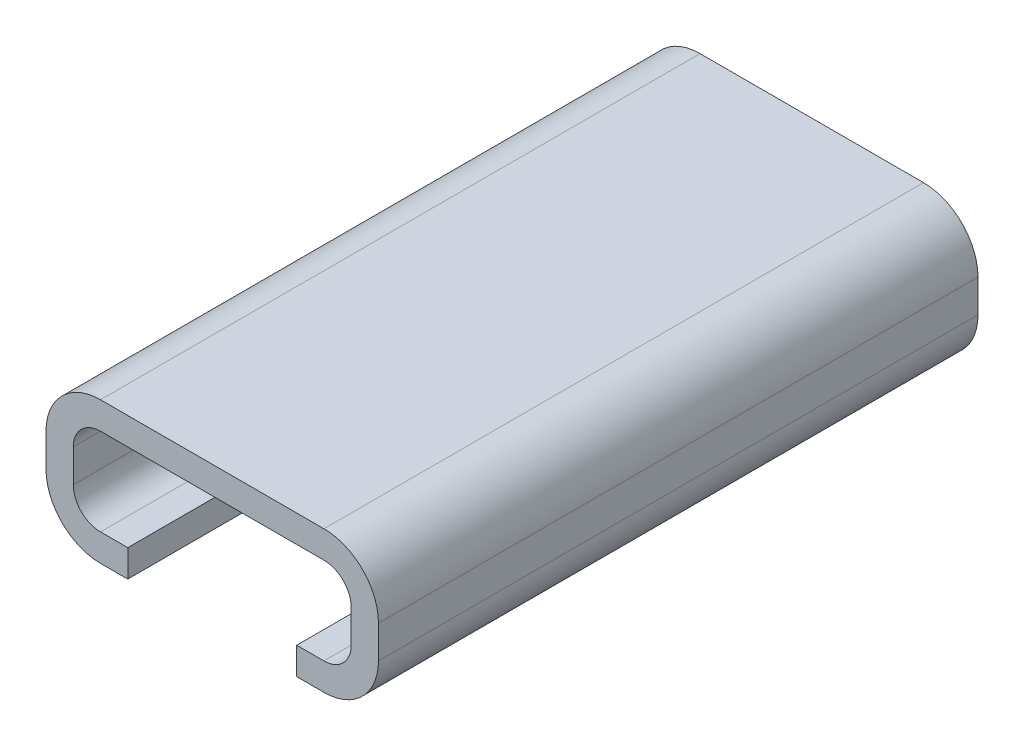
ISO-10303-21;
HEADER;
FILE_DESCRIPTION(('STEP AP214'),'2;1');
FILE_NAME('part.step','',(''),(''),'','','');
FILE_SCHEMA(('AUTOMOTIVE_DESIGN { 1 0 10303 214 1 1 1 1 }'));
ENDSEC;
DATA;
#1=APPLICATION_CONTEXT('core data for automotive mechanical design processes');
#2=APPLICATION_PROTOCOL_DEFINITION('international standard','automotive_design',2000,#1);
#3=PRODUCT_CONTEXT('',#1,'mechanical');
#4=PRODUCT('Part','Part','',(#3));
#5=PRODUCT_RELATED_PRODUCT_CATEGORY('part','',(#4));
#6=PRODUCT_DEFINITION_FORMATION('','',#4);
#7=PRODUCT_DEFINITION_CONTEXT('part definition',#1,'design');
#8=PRODUCT_DEFINITION('design','',#6,#7);
#9=PRODUCT_DEFINITION_SHAPE('','',#8);
#10=(LENGTH_UNIT() NAMED_UNIT(*) SI_UNIT(.MILLI.,.METRE.));
#11=(NAMED_UNIT(*) PLANE_ANGLE_UNIT() SI_UNIT($,.RADIAN.));
#12=(NAMED_UNIT(*) SI_UNIT($,.STERADIAN.) SOLID_ANGLE_UNIT());
#13=UNCERTAINTY_MEASURE_WITH_UNIT(LENGTH_MEASURE(1.E-05),#10,'distance_accuracy_value','');
#14=(GEOMETRIC_REPRESENTATION_CONTEXT(3) GLOBAL_UNCERTAINTY_ASSIGNED_CONTEXT((#13)) GLOBAL_UNIT_ASSIGNED_CONTEXT((#10,
#11,#12)) REPRESENTATION_CONTEXT('',''));
#15=CARTESIAN_POINT('',(0.,0.,0.));
#16=DIRECTION('',(0.,0.,1.));
#17=DIRECTION('',(1.,0.,0.));
#18=AXIS2_PLACEMENT_3D('',#15,#16,#17);
#19=CARTESIAN_POINT('',(4.1,-1.6,10.));
#20=DIRECTION('',(0.,-1.,0.));
#21=DIRECTION('',(0.,0.,-1.));
#22=AXIS2_PLACEMENT_3D('',#19,#20,#21);
#23=PLANE('',#22);
#24=DIRECTION('',(-1.,0.,0.));
#25=VECTOR('',#24,1.);
#26=CARTESIAN_POINT('',(4.1,-1.6,10.));
#27=LINE('',#26,#25);
#28=CARTESIAN_POINT('',(-3.1,-1.6,10.));
#29=VERTEX_POINT('',#28);
#30=CARTESIAN_POINT('',(-4.1,-1.6,10.));
#31=VERTEX_POINT('',#30);
#32=EDGE_CURVE('E444',#29,#31,#27,.T.);
#33=ORIENTED_EDGE('',*,*,#32,.F.);
#34=DIRECTION('',(0.,0.,1.));
#35=VECTOR('',#34,1.);
#36=CARTESIAN_POINT('',(-3.1,-1.6,10.));
#37=LINE('',#36,#35);
#38=CARTESIAN_POINT('',(-3.1,-1.6,0.));
#39=VERTEX_POINT('',#38);
#40=EDGE_CURVE('E311',#39,#29,#37,.T.);
#41=ORIENTED_EDGE('',*,*,#40,.F.);
#42=DIRECTION('',(-1.,0.,0.));
#43=VECTOR('',#42,1.);
#44=CARTESIAN_POINT('',(4.1,-1.6,0.));
#45=LINE('',#44,#43);
#46=CARTESIAN_POINT('',(-4.1,-1.6,0.));
#47=VERTEX_POINT('',#46);
#48=EDGE_CURVE('E468',#39,#47,#45,.T.);
#49=ORIENTED_EDGE('',*,*,#48,.T.);
#50=DIRECTION('',(0.,0.,-1.));
#51=VECTOR('',#50,1.);
#52=CARTESIAN_POINT('',(-4.1,-1.6,10.));
#53=LINE('',#52,#51);
#54=EDGE_CURVE('E497',#31,#47,#53,.T.);
#55=ORIENTED_EDGE('',*,*,#54,.F.);
#56=EDGE_LOOP('',(#33,#41,#49,#55));
#57=FACE_BOUND('',#56,.T.);
#58=ADVANCED_FACE('F83',(#57),#23,.F.);
#59=CARTESIAN_POINT('',(4.1,-1.6,-12.));
#60=DIRECTION('',(0.,-1.,0.));
#61=DIRECTION('',(0.,0.,1.));
#62=AXIS2_PLACEMENT_3D('',#59,#60,#61);
#63=PLANE('',#62);
#64=DIRECTION('',(-1.,0.,0.));
#65=VECTOR('',#64,1.);
#66=CARTESIAN_POINT('',(4.1,-1.6,-12.));
#67=LINE('',#66,#65);
#68=CARTESIAN_POINT('',(4.1,-1.6,-12.));
#69=VERTEX_POINT('',#68);
#70=CARTESIAN_POINT('',(3.1,-1.6,-12.));
#71=VERTEX_POINT('',#70);
#72=EDGE_CURVE('E354',#69,#71,#67,.T.);
#73=ORIENTED_EDGE('',*,*,#72,.T.);
#74=DIRECTION('',(0.,0.,-1.));
#75=VECTOR('',#74,1.);
#76=CARTESIAN_POINT('',(3.1,-1.6,-12.));
#77=LINE('',#76,#75);
#78=CARTESIAN_POINT('',(3.1,-1.6,-1.99999999999999));
#79=VERTEX_POINT('',#78);
#80=EDGE_CURVE('E374',#79,#71,#77,.T.);
#81=ORIENTED_EDGE('',*,*,#80,.F.);
#82=DIRECTION('',(-1.,0.,0.));
#83=VECTOR('',#82,1.);
#84=CARTESIAN_POINT('',(4.1,-1.6,-2.));
#85=LINE('',#84,#83);
#86=CARTESIAN_POINT('',(4.1,-1.6,-2.));
#87=VERTEX_POINT('',#86);
#88=EDGE_CURVE('E298',#87,#79,#85,.T.);
#89=ORIENTED_EDGE('',*,*,#88,.F.);
#90=DIRECTION('',(0.,0.,1.));
#91=VECTOR('',#90,1.);
#92=CARTESIAN_POINT('',(4.1,-1.6,-12.));
#93=LINE('',#92,#91);
#94=EDGE_CURVE('E398',#69,#87,#93,.T.);
#95=ORIENTED_EDGE('',*,*,#94,.F.);
#96=EDGE_LOOP('',(#73,#81,#89,#95));
#97=FACE_BOUND('',#96,.T.);
#98=ADVANCED_FACE('F624',(#97),#63,.F.);
#99=CARTESIAN_POINT('',(4.1,0.600000000000001,10.));
#100=DIRECTION('',(0.,0.,-1.));
#101=DIRECTION('',(-1.,0.,0.));
#102=AXIS2_PLACEMENT_3D('',#99,#100,#101);
#103=PLANE('',#102);
#104=DIRECTION('',(-1.,0.,0.));
#105=VECTOR('',#104,1.);
#106=CARTESIAN_POINT('',(4.1,-2.6,10.));
#107=LINE('',#106,#105);
#108=CARTESIAN_POINT('',(-3.1,-2.6,10.));
#109=VERTEX_POINT('',#108);
#110=CARTESIAN_POINT('',(-4.1,-2.6,10.));
#111=VERTEX_POINT('',#110);
#112=EDGE_CURVE('E515',#109,#111,#107,.T.);
#113=ORIENTED_EDGE('',*,*,#112,.F.);
#114=DIRECTION('',(0.,-1.,0.));
#115=VECTOR('',#114,1.);
#116=CARTESIAN_POINT('',(-3.1,10.1660528640662,10.));
#117=LINE('',#116,#115);
#118=EDGE_CURVE('E327',#29,#109,#117,.T.);
#119=ORIENTED_EDGE('',*,*,#118,.F.);
#120=ORIENTED_EDGE('',*,*,#32,.T.);
#121=CARTESIAN_POINT('',(-4.1,-0.600000000000001,10.));
#122=DIRECTION('',(0.,0.,-1.));
#123=DIRECTION('',(-1.,0.,0.));
#124=AXIS2_PLACEMENT_3D('',#121,#122,#123);
#125=CIRCLE('',#124,0.999999999999999);
#126=CARTESIAN_POINT('',(-5.1,-0.600000000000001,10.));
#127=VERTEX_POINT('',#126);
#128=EDGE_CURVE('E441',#31,#127,#125,.T.);
#129=ORIENTED_EDGE('',*,*,#128,.T.);
#130=DIRECTION('',(0.,1.,0.));
#131=VECTOR('',#130,1.);
#132=CARTESIAN_POINT('',(-5.1,-0.600000000000001,10.));
#133=LINE('',#132,#131);
#134=CARTESIAN_POINT('',(-5.1,0.600000000000001,10.));
#135=VERTEX_POINT('',#134);
#136=EDGE_CURVE('E437',#127,#135,#133,.T.);
#137=ORIENTED_EDGE('',*,*,#136,.T.);
#138=CARTESIAN_POINT('',(-4.1,0.600000000000001,10.));
#139=DIRECTION('',(0.,0.,1.));
#140=DIRECTION('',(1.,0.,0.));
#141=AXIS2_PLACEMENT_3D('',#138,#139,#140);
#142=CIRCLE('',#141,0.999999999999999);
#143=CARTESIAN_POINT('',(-4.1,1.6,10.));
#144=VERTEX_POINT('',#143);
#145=EDGE_CURVE('E435',#144,#135,#142,.T.);
#146=ORIENTED_EDGE('',*,*,#145,.F.);
#147=DIRECTION('',(1.,0.,0.));
#148=VECTOR('',#147,1.);
#149=CARTESIAN_POINT('',(-4.1,1.6,10.));
#150=LINE('',#149,#148);
#151=CARTESIAN_POINT('',(4.1,1.6,10.));
#152=VERTEX_POINT('',#151);
#153=EDGE_CURVE('E457',#144,#152,#150,.T.);
#154=ORIENTED_EDGE('',*,*,#153,.T.);
#155=CARTESIAN_POINT('',(4.1,0.600000000000001,10.));
#156=DIRECTION('',(0.,0.,-1.));
#157=DIRECTION('',(-1.,0.,0.));
#158=AXIS2_PLACEMENT_3D('',#155,#156,#157);
#159=CIRCLE('',#158,0.999999999999999);
#160=CARTESIAN_POINT('',(5.1,0.600000000000001,10.));
#161=VERTEX_POINT('',#160);
#162=EDGE_CURVE('E454',#152,#161,#159,.T.);
#163=ORIENTED_EDGE('',*,*,#162,.T.);
#164=DIRECTION('',(0.,-1.,0.));
#165=VECTOR('',#164,1.);
#166=CARTESIAN_POINT('',(5.1,0.600000000000001,10.));
#167=LINE('',#166,#165);
#168=CARTESIAN_POINT('',(5.1,-0.600000000000001,10.));
#169=VERTEX_POINT('',#168);
#170=EDGE_CURVE('E451',#161,#169,#167,.T.);
#171=ORIENTED_EDGE('',*,*,#170,.T.);
#172=CARTESIAN_POINT('',(4.1,-0.600000000000001,10.));
#173=DIRECTION('',(0.,0.,-1.));
#174=DIRECTION('',(-1.,0.,0.));
#175=AXIS2_PLACEMENT_3D('',#172,#173,#174);
#176=CIRCLE('',#175,0.999999999999999);
#177=CARTESIAN_POINT('',(4.1,-1.6,10.));
#178=VERTEX_POINT('',#177);
#179=EDGE_CURVE('E448',#169,#178,#176,.T.);
#180=ORIENTED_EDGE('',*,*,#179,.T.);
#181=CARTESIAN_POINT('',(3.1,-1.6,10.));
#182=VERTEX_POINT('',#181);
#183=EDGE_CURVE('E445',#178,#182,#27,.T.);
#184=ORIENTED_EDGE('',*,*,#183,.T.);
#185=DIRECTION('',(0.,-1.,0.));
#186=VECTOR('',#185,1.);
#187=CARTESIAN_POINT('',(3.1,10.1660528640662,10.));
#188=LINE('',#187,#186);
#189=CARTESIAN_POINT('',(3.1,-2.6,10.));
#190=VERTEX_POINT('',#189);
#191=EDGE_CURVE('E338',#182,#190,#188,.T.);
#192=ORIENTED_EDGE('',*,*,#191,.T.);
#193=CARTESIAN_POINT('',(4.1,-2.6,10.));
#194=VERTEX_POINT('',#193);
#195=EDGE_CURVE('E516',#194,#190,#107,.T.);
#196=ORIENTED_EDGE('',*,*,#195,.F.);
#197=CARTESIAN_POINT('',(4.1,-0.600000000000001,10.));
#198=DIRECTION('',(0.,0.,-1.));
#199=DIRECTION('',(-1.,0.,0.));
#200=AXIS2_PLACEMENT_3D('',#197,#198,#199);
#201=CIRCLE('',#200,2.);
#202=CARTESIAN_POINT('',(6.1,-0.600000000000001,10.));
#203=VERTEX_POINT('',#202);
#204=EDGE_CURVE('E512',#203,#194,#201,.T.);
#205=ORIENTED_EDGE('',*,*,#204,.F.);
#206=DIRECTION('',(0.,-1.,0.));
#207=VECTOR('',#206,1.);
#208=CARTESIAN_POINT('',(6.1,0.600000000000001,10.));
#209=LINE('',#208,#207);
#210=CARTESIAN_POINT('',(6.1,0.600000000000001,10.));
#211=VERTEX_POINT('',#210);
#212=EDGE_CURVE('E509',#211,#203,#209,.T.);
#213=ORIENTED_EDGE('',*,*,#212,.F.);
#214=CARTESIAN_POINT('',(4.1,0.600000000000001,10.));
#215=DIRECTION('',(0.,0.,-1.));
#216=DIRECTION('',(-1.,0.,0.));
#217=AXIS2_PLACEMENT_3D('',#214,#215,#216);
#218=CIRCLE('',#217,2.);
#219=CARTESIAN_POINT('',(4.1,2.6,10.));
#220=VERTEX_POINT('',#219);
#221=EDGE_CURVE('E506',#220,#211,#218,.T.);
#222=ORIENTED_EDGE('',*,*,#221,.F.);
#223=DIRECTION('',(1.,0.,0.));
#224=VECTOR('',#223,1.);
#225=CARTESIAN_POINT('',(-4.1,2.6,10.));
#226=LINE('',#225,#224);
#227=CARTESIAN_POINT('',(-4.1,2.6,10.));
#228=VERTEX_POINT('',#227);
#229=EDGE_CURVE('E527',#228,#220,#226,.T.);
#230=ORIENTED_EDGE('',*,*,#229,.F.);
#231=CARTESIAN_POINT('',(-4.1,0.600000000000001,10.));
#232=DIRECTION('',(0.,0.,1.));
#233=DIRECTION('',(1.,0.,0.));
#234=AXIS2_PLACEMENT_3D('',#231,#232,#233);
#235=CIRCLE('',#234,2.);
#236=CARTESIAN_POINT('',(-6.1,0.600000000000001,10.));
#237=VERTEX_POINT('',#236);
#238=EDGE_CURVE('E525',#228,#237,#235,.T.);
#239=ORIENTED_EDGE('',*,*,#238,.T.);
#240=DIRECTION('',(0.,1.,0.));
#241=VECTOR('',#240,1.);
#242=CARTESIAN_POINT('',(-6.1,-0.600000000000001,10.));
#243=LINE('',#242,#241);
#244=CARTESIAN_POINT('',(-6.1,-0.600000000000001,10.));
#245=VERTEX_POINT('',#244);
#246=EDGE_CURVE('E522',#245,#237,#243,.T.);
#247=ORIENTED_EDGE('',*,*,#246,.F.);
#248=CARTESIAN_POINT('',(-4.1,-0.600000000000001,10.));
#249=DIRECTION('',(0.,0.,-1.));
#250=DIRECTION('',(-1.,0.,0.));
#251=AXIS2_PLACEMENT_3D('',#248,#249,#250);
#252=CIRCLE('',#251,2.);
#253=EDGE_CURVE('E519',#111,#245,#252,.T.);
#254=ORIENTED_EDGE('',*,*,#253,.F.);
#255=EDGE_LOOP('',(#113,#119,#120,#129,#137,#146,#154,#163,#171,#180,#184,#192,#196,#205,#213,
#222,#230,#239,#247,#254));
#256=FACE_BOUND('',#255,.T.);
#257=ADVANCED_FACE('F558',(#256),#103,.F.);
#258=CARTESIAN_POINT('',(4.1,0.600000000000001,10.));
#259=DIRECTION('',(0.,0.,-1.));
#260=DIRECTION('',(-1.,0.,0.));
#261=AXIS2_PLACEMENT_3D('',#258,#259,#260);
#262=CYLINDRICAL_SURFACE('',#261,2.);
#263=DIRECTION('',(0.,0.,-1.));
#264=VECTOR('',#263,1.);
#265=CARTESIAN_POINT('',(6.1,0.600000000000001,10.));
#266=LINE('',#265,#264);
#267=CARTESIAN_POINT('',(6.1,0.600000000000001,-12.));
#268=VERTEX_POINT('',#267);
#269=EDGE_CURVE('E87',#211,#268,#266,.T.);
#270=ORIENTED_EDGE('',*,*,#269,.T.);
#271=CARTESIAN_POINT('',(4.1,0.600000000000001,-12.));
#272=DIRECTION('',(0.,0.,-1.));
#273=DIRECTION('',(-1.,0.,0.));
#274=AXIS2_PLACEMENT_3D('',#271,#272,#273);
#275=CIRCLE('',#274,2.);
#276=CARTESIAN_POINT('',(4.1,2.6,-12.));
#277=VERTEX_POINT('',#276);
#278=EDGE_CURVE('E410',#277,#268,#275,.T.);
#279=ORIENTED_EDGE('',*,*,#278,.F.);
#280=DIRECTION('',(0.,0.,-1.));
#281=VECTOR('',#280,1.);
#282=CARTESIAN_POINT('',(4.1,2.6,10.));
#283=LINE('',#282,#281);
#284=EDGE_CURVE('E12',#220,#277,#283,.T.);
#285=ORIENTED_EDGE('',*,*,#284,.F.);
#286=ORIENTED_EDGE('',*,*,#221,.T.);
#287=EDGE_LOOP('',(#270,#279,#285,#286));
#288=FACE_BOUND('',#287,.T.);
#289=ADVANCED_FACE('F85',(#288),#262,.T.);
#290=CARTESIAN_POINT('',(4.1,2.6,10.));
#291=DIRECTION('',(0.,-1.,0.));
#292=DIRECTION('',(0.,0.,-1.));
#293=AXIS2_PLACEMENT_3D('',#290,#291,#292);
#294=PLANE('',#293);
#295=ORIENTED_EDGE('',*,*,#284,.T.);
#296=DIRECTION('',(1.,0.,0.));
#297=VECTOR('',#296,1.);
#298=CARTESIAN_POINT('',(-4.1,2.6,-12.));
#299=LINE('',#298,#297);
#300=CARTESIAN_POINT('',(-4.1,2.6,-12.));
#301=VERTEX_POINT('',#300);
#302=EDGE_CURVE('E431',#301,#277,#299,.T.);
#303=ORIENTED_EDGE('',*,*,#302,.F.);
#304=DIRECTION('',(0.,0.,-1.));
#305=VECTOR('',#304,1.);
#306=CARTESIAN_POINT('',(-4.1,2.6,10.));
#307=LINE('',#306,#305);
#308=EDGE_CURVE('E92',#228,#301,#307,.T.);
#309=ORIENTED_EDGE('',*,*,#308,.F.);
#310=ORIENTED_EDGE('',*,*,#229,.T.);
#311=EDGE_LOOP('',(#295,#303,#309,#310));
#312=FACE_BOUND('',#311,.T.);
#313=ADVANCED_FACE('F553',(#312),#294,.F.);
#314=CARTESIAN_POINT('',(-4.1,0.600000000000001,10.));
#315=DIRECTION('',(0.,0.,-1.));
#316=DIRECTION('',(-1.,0.,0.));
#317=AXIS2_PLACEMENT_3D('',#314,#315,#316);
#318=CYLINDRICAL_SURFACE('',#317,2.);
#319=ORIENTED_EDGE('',*,*,#308,.T.);
#320=CARTESIAN_POINT('',(-4.1,0.600000000000001,-12.));
#321=DIRECTION('',(0.,0.,1.));
#322=DIRECTION('',(1.,0.,0.));
#323=AXIS2_PLACEMENT_3D('',#320,#321,#322);
#324=CIRCLE('',#323,2.);
#325=CARTESIAN_POINT('',(-6.1,0.600000000000001,-12.));
#326=VERTEX_POINT('',#325);
#327=EDGE_CURVE('E428',#301,#326,#324,.T.);
#328=ORIENTED_EDGE('',*,*,#327,.T.);
#329=DIRECTION('',(0.,0.,-1.));
#330=VECTOR('',#329,1.);
#331=CARTESIAN_POINT('',(-6.1,0.600000000000001,10.));
#332=LINE('',#331,#330);
#333=EDGE_CURVE('E530',#237,#326,#332,.T.);
#334=ORIENTED_EDGE('',*,*,#333,.F.);
#335=ORIENTED_EDGE('',*,*,#238,.F.);
#336=EDGE_LOOP('',(#319,#328,#334,#335));
#337=FACE_BOUND('',#336,.T.);
#338=ADVANCED_FACE('F683',(#337),#318,.T.);
#339=CARTESIAN_POINT('',(-6.1,-0.600000000000001,10.));
#340=DIRECTION('',(-1.,0.,0.));
#341=DIRECTION('',(0.,-1.,0.));
#342=AXIS2_PLACEMENT_3D('',#339,#340,#341);
#343=PLANE('',#342);
#344=ORIENTED_EDGE('',*,*,#333,.T.);
#345=DIRECTION('',(0.,1.,0.));
#346=VECTOR('',#345,1.);
#347=CARTESIAN_POINT('',(-6.1,-0.600000000000001,-12.));
#348=LINE('',#347,#346);
#349=CARTESIAN_POINT('',(-6.1,-0.600000000000001,-12.));
#350=VERTEX_POINT('',#349);
#351=EDGE_CURVE('E425',#350,#326,#348,.T.);
#352=ORIENTED_EDGE('',*,*,#351,.F.);
#353=DIRECTION('',(0.,0.,-1.));
#354=VECTOR('',#353,1.);
#355=CARTESIAN_POINT('',(-6.1,-0.600000000000001,10.));
#356=LINE('',#355,#354);
#357=EDGE_CURVE('E532',#245,#350,#356,.T.);
#358=ORIENTED_EDGE('',*,*,#357,.F.);
#359=ORIENTED_EDGE('',*,*,#246,.T.);
#360=EDGE_LOOP('',(#344,#352,#358,#359));
#361=FACE_BOUND('',#360,.T.);
#362=ADVANCED_FACE('F686',(#361),#343,.T.);
#363=CARTESIAN_POINT('',(-4.1,-0.600000000000001,10.));
#364=DIRECTION('',(0.,0.,-1.));
#365=DIRECTION('',(-1.,0.,0.));
#366=AXIS2_PLACEMENT_3D('',#363,#364,#365);
#367=CYLINDRICAL_SURFACE('',#366,2.);
#368=ORIENTED_EDGE('',*,*,#357,.T.);
#369=CARTESIAN_POINT('',(-4.1,-0.600000000000001,-12.));
#370=DIRECTION('',(0.,0.,-1.));
#371=DIRECTION('',(-1.,0.,0.));
#372=AXIS2_PLACEMENT_3D('',#369,#370,#371);
#373=CIRCLE('',#372,2.);
#374=CARTESIAN_POINT('',(-4.1,-2.6,-12.));
#375=VERTEX_POINT('',#374);
#376=EDGE_CURVE('E422',#375,#350,#373,.T.);
#377=ORIENTED_EDGE('',*,*,#376,.F.);
#378=DIRECTION('',(0.,0.,-1.));
#379=VECTOR('',#378,1.);
#380=CARTESIAN_POINT('',(-4.1,-2.6,10.));
#381=LINE('',#380,#379);
#382=EDGE_CURVE('E534',#111,#375,#381,.T.);
#383=ORIENTED_EDGE('',*,*,#382,.F.);
#384=ORIENTED_EDGE('',*,*,#253,.T.);
#385=EDGE_LOOP('',(#368,#377,#383,#384));
#386=FACE_BOUND('',#385,.T.);
#387=ADVANCED_FACE('F611',(#386),#367,.T.);
#388=CARTESIAN_POINT('',(4.1,-2.6,10.));
#389=DIRECTION('',(0.,-1.,0.));
#390=DIRECTION('',(1.,0.,0.));
#391=AXIS2_PLACEMENT_3D('',#388,#389,#390);
#392=PLANE('',#391);
#393=DIRECTION('',(0.,0.,1.));
#394=VECTOR('',#393,1.);
#395=CARTESIAN_POINT('',(3.1,-2.6,-12.));
#396=LINE('',#395,#394);
#397=CARTESIAN_POINT('',(3.1,-2.6,-12.));
#398=VERTEX_POINT('',#397);
#399=CARTESIAN_POINT('',(3.1,-2.6,-1.99999999999999));
#400=VERTEX_POINT('',#399);
#401=EDGE_CURVE('E304',#398,#400,#396,.T.);
#402=ORIENTED_EDGE('',*,*,#401,.F.);
#403=DIRECTION('',(-1.,0.,0.));
#404=VECTOR('',#403,1.);
#405=CARTESIAN_POINT('',(4.1,-2.6,-12.));
#406=LINE('',#405,#404);
#407=CARTESIAN_POINT('',(4.1,-2.6,-12.));
#408=VERTEX_POINT('',#407);
#409=EDGE_CURVE('E420',#408,#398,#406,.T.);
#410=ORIENTED_EDGE('',*,*,#409,.F.);
#411=DIRECTION('',(0.,0.,-1.));
#412=VECTOR('',#411,1.);
#413=CARTESIAN_POINT('',(4.1,-2.6,10.));
#414=LINE('',#413,#412);
#415=EDGE_CURVE('E537',#194,#408,#414,.T.);
#416=ORIENTED_EDGE('',*,*,#415,.F.);
#417=ORIENTED_EDGE('',*,*,#195,.T.);
#418=DIRECTION('',(0.,0.,1.));
#419=VECTOR('',#418,1.);
#420=CARTESIAN_POINT('',(3.1,-2.6,10.));
#421=LINE('',#420,#419);
#422=CARTESIAN_POINT('',(3.1,-2.6,0.));
#423=VERTEX_POINT('',#422);
#424=EDGE_CURVE('E334',#423,#190,#421,.T.);
#425=ORIENTED_EDGE('',*,*,#424,.F.);
#426=DIRECTION('',(1.,0.,0.));
#427=VECTOR('',#426,1.);
#428=CARTESIAN_POINT('',(-3.1,-2.6,0.));
#429=LINE('',#428,#427);
#430=CARTESIAN_POINT('',(-3.1,-2.6,0.));
#431=VERTEX_POINT('',#430);
#432=EDGE_CURVE('E332',#431,#423,#429,.T.);
#433=ORIENTED_EDGE('',*,*,#432,.F.);
#434=DIRECTION('',(0.,0.,-1.));
#435=VECTOR('',#434,1.);
#436=CARTESIAN_POINT('',(-3.1,-2.6,10.));
#437=LINE('',#436,#435);
#438=EDGE_CURVE('E329',#109,#431,#437,.T.);
#439=ORIENTED_EDGE('',*,*,#438,.F.);
#440=ORIENTED_EDGE('',*,*,#112,.T.);
#441=ORIENTED_EDGE('',*,*,#382,.T.);
#442=CARTESIAN_POINT('',(-3.1,-2.6,-12.));
#443=VERTEX_POINT('',#442);
#444=EDGE_CURVE('E419',#443,#375,#406,.T.);
#445=ORIENTED_EDGE('',*,*,#444,.F.);
#446=DIRECTION('',(0.,0.,-1.));
#447=VECTOR('',#446,1.);
#448=CARTESIAN_POINT('',(-3.1,-2.6,-12.));
#449=LINE('',#448,#447);
#450=CARTESIAN_POINT('',(-3.1,-2.6,-1.99999999999999));
#451=VERTEX_POINT('',#450);
#452=EDGE_CURVE('E301',#451,#443,#449,.T.);
#453=ORIENTED_EDGE('',*,*,#452,.F.);
#454=DIRECTION('',(-1.,0.,0.));
#455=VECTOR('',#454,1.);
#456=CARTESIAN_POINT('',(3.1,-2.6,-1.99999999999999));
#457=LINE('',#456,#455);
#458=EDGE_CURVE('E295',#400,#451,#457,.T.);
#459=ORIENTED_EDGE('',*,*,#458,.F.);
#460=EDGE_LOOP('',(#402,#410,#416,#417,#425,#433,#439,#440,#441,#445,#453,#459));
#461=FACE_BOUND('',#460,.T.);
#462=ADVANCED_FACE('F313',(#461),#392,.T.);
#463=CARTESIAN_POINT('',(4.1,-0.600000000000001,10.));
#464=DIRECTION('',(0.,0.,-1.));
#465=DIRECTION('',(-1.,0.,0.));
#466=AXIS2_PLACEMENT_3D('',#463,#464,#465);
#467=CYLINDRICAL_SURFACE('',#466,2.);
#468=ORIENTED_EDGE('',*,*,#415,.T.);
#469=CARTESIAN_POINT('',(4.1,-0.600000000000001,-12.));
#470=DIRECTION('',(0.,0.,-1.));
#471=DIRECTION('',(-1.,0.,0.));
#472=AXIS2_PLACEMENT_3D('',#469,#470,#471);
#473=CIRCLE('',#472,2.);
#474=CARTESIAN_POINT('',(6.1,-0.600000000000001,-12.));
#475=VERTEX_POINT('',#474);
#476=EDGE_CURVE('E416',#475,#408,#473,.T.);
#477=ORIENTED_EDGE('',*,*,#476,.F.);
#478=DIRECTION('',(0.,0.,-1.));
#479=VECTOR('',#478,1.);
#480=CARTESIAN_POINT('',(6.1,-0.600000000000001,10.));
#481=LINE('',#480,#479);
#482=EDGE_CURVE('E538',#203,#475,#481,.T.);
#483=ORIENTED_EDGE('',*,*,#482,.F.);
#484=ORIENTED_EDGE('',*,*,#204,.T.);
#485=EDGE_LOOP('',(#468,#477,#483,#484));
#486=FACE_BOUND('',#485,.T.);
#487=ADVANCED_FACE('F562',(#486),#467,.T.);
#488=CARTESIAN_POINT('',(6.1,0.600000000000001,10.));
#489=DIRECTION('',(1.,0.,0.));
#490=DIRECTION('',(0.,1.,0.));
#491=AXIS2_PLACEMENT_3D('',#488,#489,#490);
#492=PLANE('',#491);
#493=ORIENTED_EDGE('',*,*,#482,.T.);
#494=DIRECTION('',(0.,-1.,0.));
#495=VECTOR('',#494,1.);
#496=CARTESIAN_POINT('',(6.1,0.600000000000001,-12.));
#497=LINE('',#496,#495);
#498=EDGE_CURVE('E413',#268,#475,#497,.T.);
#499=ORIENTED_EDGE('',*,*,#498,.F.);
#500=ORIENTED_EDGE('',*,*,#269,.F.);
#501=ORIENTED_EDGE('',*,*,#212,.T.);
#502=EDGE_LOOP('',(#493,#499,#500,#501));
#503=FACE_BOUND('',#502,.T.);
#504=ADVANCED_FACE('F547',(#503),#492,.T.);
#505=CARTESIAN_POINT('',(-4.1,0.600000000000001,10.));
#506=DIRECTION('',(0.,0.,-1.));
#507=DIRECTION('',(-1.,0.,0.));
#508=AXIS2_PLACEMENT_3D('',#505,#506,#507);
#509=CYLINDRICAL_SURFACE('',#508,0.999999999999999);
#510=CARTESIAN_POINT('',(-4.1,0.600000000000001,0.));
#511=DIRECTION('',(0.,0.,1.));
#512=DIRECTION('',(1.,0.,0.));
#513=AXIS2_PLACEMENT_3D('',#510,#511,#512);
#514=CIRCLE('',#513,0.999999999999999);
#515=CARTESIAN_POINT('',(-4.1,1.6,0.));
#516=VERTEX_POINT('',#515);
#517=CARTESIAN_POINT('',(-5.1,0.600000000000001,0.));
#518=VERTEX_POINT('',#517);
#519=EDGE_CURVE('E434',#516,#518,#514,.T.);
#520=ORIENTED_EDGE('',*,*,#519,.F.);
#521=DIRECTION('',(0.,0.,-1.));
#522=VECTOR('',#521,1.);
#523=CARTESIAN_POINT('',(-4.1,1.6,10.));
#524=LINE('',#523,#522);
#525=EDGE_CURVE('E460',#144,#516,#524,.T.);
#526=ORIENTED_EDGE('',*,*,#525,.F.);
#527=ORIENTED_EDGE('',*,*,#145,.T.);
#528=DIRECTION('',(0.,0.,-1.));
#529=VECTOR('',#528,1.);
#530=CARTESIAN_POINT('',(-5.1,0.600000000000001,10.));
#531=LINE('',#530,#529);
#532=EDGE_CURVE('E503',#135,#518,#531,.T.);
#533=ORIENTED_EDGE('',*,*,#532,.T.);
#534=EDGE_LOOP('',(#520,#526,#527,#533));
#535=FACE_BOUND('',#534,.T.);
#536=ADVANCED_FACE('F586',(#535),#509,.F.);
#537=CARTESIAN_POINT('',(-5.1,-0.600000000000001,10.));
#538=DIRECTION('',(-1.,0.,0.));
#539=DIRECTION('',(0.,0.,1.));
#540=AXIS2_PLACEMENT_3D('',#537,#538,#539);
#541=PLANE('',#540);
#542=DIRECTION('',(0.,1.,0.));
#543=VECTOR('',#542,1.);
#544=CARTESIAN_POINT('',(-5.1,-0.600000000000001,0.));
#545=LINE('',#544,#543);
#546=CARTESIAN_POINT('',(-5.1,-0.600000000000001,0.));
#547=VERTEX_POINT('',#546);
#548=EDGE_CURVE('E462',#547,#518,#545,.T.);
#549=ORIENTED_EDGE('',*,*,#548,.T.);
#550=ORIENTED_EDGE('',*,*,#532,.F.);
#551=ORIENTED_EDGE('',*,*,#136,.F.);
#552=DIRECTION('',(0.,0.,-1.));
#553=VECTOR('',#552,1.);
#554=CARTESIAN_POINT('',(-5.1,-0.600000000000001,10.));
#555=LINE('',#554,#553);
#556=EDGE_CURVE('E500',#127,#547,#555,.T.);
#557=ORIENTED_EDGE('',*,*,#556,.T.);
#558=EDGE_LOOP('',(#549,#550,#551,#557));
#559=FACE_BOUND('',#558,.T.);
#560=ADVANCED_FACE('F593',(#559),#541,.F.);
#561=CARTESIAN_POINT('',(-4.1,-0.600000000000001,10.));
#562=DIRECTION('',(0.,0.,-1.));
#563=DIRECTION('',(-1.,0.,0.));
#564=AXIS2_PLACEMENT_3D('',#561,#562,#563);
#565=CYLINDRICAL_SURFACE('',#564,0.999999999999999);
#566=CARTESIAN_POINT('',(-4.1,-0.600000000000001,0.));
#567=DIRECTION('',(0.,0.,-1.));
#568=DIRECTION('',(-1.,0.,0.));
#569=AXIS2_PLACEMENT_3D('',#566,#567,#568);
#570=CIRCLE('',#569,0.999999999999999);
#571=EDGE_CURVE('E465',#47,#547,#570,.T.);
#572=ORIENTED_EDGE('',*,*,#571,.T.);
#573=ORIENTED_EDGE('',*,*,#556,.F.);
#574=ORIENTED_EDGE('',*,*,#128,.F.);
#575=ORIENTED_EDGE('',*,*,#54,.T.);
#576=EDGE_LOOP('',(#572,#573,#574,#575));
#577=FACE_BOUND('',#576,.T.);
#578=ADVANCED_FACE('F599',(#577),#565,.F.);
#579=CARTESIAN_POINT('',(4.1,-1.6,0.));
#580=VERTEX_POINT('',#579);
#581=CARTESIAN_POINT('',(3.1,-1.6,0.));
#582=VERTEX_POINT('',#581);
#583=EDGE_CURVE('E469',#580,#582,#45,.T.);
#584=ORIENTED_EDGE('',*,*,#583,.T.);
#585=DIRECTION('',(0.,0.,-1.));
#586=VECTOR('',#585,1.);
#587=CARTESIAN_POINT('',(3.1,-1.6,10.));
#588=LINE('',#587,#586);
#589=EDGE_CURVE('E325',#182,#582,#588,.T.);
#590=ORIENTED_EDGE('',*,*,#589,.F.);
#591=ORIENTED_EDGE('',*,*,#183,.F.);
#592=DIRECTION('',(0.,0.,-1.));
#593=VECTOR('',#592,1.);
#594=CARTESIAN_POINT('',(4.1,-1.6,10.));
#595=LINE('',#594,#593);
#596=EDGE_CURVE('E494',#178,#580,#595,.T.);
#597=ORIENTED_EDGE('',*,*,#596,.T.);
#598=EDGE_LOOP('',(#584,#590,#591,#597));
#599=FACE_BOUND('',#598,.T.);
#600=ADVANCED_FACE('F573',(#599),#23,.F.);
#601=CARTESIAN_POINT('',(4.1,-0.600000000000001,10.));
#602=DIRECTION('',(0.,0.,-1.));
#603=DIRECTION('',(-1.,0.,0.));
#604=AXIS2_PLACEMENT_3D('',#601,#602,#603);
#605=CYLINDRICAL_SURFACE('',#604,0.999999999999999);
#606=CARTESIAN_POINT('',(4.1,-0.600000000000001,0.));
#607=DIRECTION('',(0.,0.,-1.));
#608=DIRECTION('',(-1.,0.,0.));
#609=AXIS2_PLACEMENT_3D('',#606,#607,#608);
#610=CIRCLE('',#609,0.999999999999999);
#611=CARTESIAN_POINT('',(5.1,-0.600000000000001,0.));
#612=VERTEX_POINT('',#611);
#613=EDGE_CURVE('E472',#612,#580,#610,.T.);
#614=ORIENTED_EDGE('',*,*,#613,.T.);
#615=ORIENTED_EDGE('',*,*,#596,.F.);
#616=ORIENTED_EDGE('',*,*,#179,.F.);
#617=DIRECTION('',(0.,0.,-1.));
#618=VECTOR('',#617,1.);
#619=CARTESIAN_POINT('',(5.1,-0.600000000000001,10.));
#620=LINE('',#619,#618);
#621=EDGE_CURVE('E491',#169,#612,#620,.T.);
#622=ORIENTED_EDGE('',*,*,#621,.T.);
#623=EDGE_LOOP('',(#614,#615,#616,#622));
#624=FACE_BOUND('',#623,.T.);
#625=ADVANCED_FACE('F576',(#624),#605,.F.);
#626=CARTESIAN_POINT('',(5.1,0.600000000000001,10.));
#627=DIRECTION('',(1.,0.,0.));
#628=DIRECTION('',(0.,0.,-1.));
#629=AXIS2_PLACEMENT_3D('',#626,#627,#628);
#630=PLANE('',#629);
#631=DIRECTION('',(0.,-1.,0.));
#632=VECTOR('',#631,1.);
#633=CARTESIAN_POINT('',(5.1,0.600000000000001,0.));
#634=LINE('',#633,#632);
#635=CARTESIAN_POINT('',(5.1,0.600000000000001,0.));
#636=VERTEX_POINT('',#635);
#637=EDGE_CURVE('E475',#636,#612,#634,.T.);
#638=ORIENTED_EDGE('',*,*,#637,.T.);
#639=ORIENTED_EDGE('',*,*,#621,.F.);
#640=ORIENTED_EDGE('',*,*,#170,.F.);
#641=DIRECTION('',(0.,0.,-1.));
#642=VECTOR('',#641,1.);
#643=CARTESIAN_POINT('',(5.1,0.600000000000001,10.));
#644=LINE('',#643,#642);
#645=EDGE_CURVE('E488',#161,#636,#644,.T.);
#646=ORIENTED_EDGE('',*,*,#645,.T.);
#647=EDGE_LOOP('',(#638,#639,#640,#646));
#648=FACE_BOUND('',#647,.T.);
#649=ADVANCED_FACE('F579',(#648),#630,.F.);
#650=CARTESIAN_POINT('',(4.1,0.600000000000001,10.));
#651=DIRECTION('',(0.,0.,-1.));
#652=DIRECTION('',(-1.,0.,0.));
#653=AXIS2_PLACEMENT_3D('',#650,#651,#652);
#654=CYLINDRICAL_SURFACE('',#653,0.999999999999999);
#655=CARTESIAN_POINT('',(4.1,0.600000000000001,0.));
#656=DIRECTION('',(0.,0.,-1.));
#657=DIRECTION('',(-1.,0.,0.));
#658=AXIS2_PLACEMENT_3D('',#655,#656,#657);
#659=CIRCLE('',#658,0.999999999999999);
#660=CARTESIAN_POINT('',(4.1,1.6,0.));
#661=VERTEX_POINT('',#660);
#662=EDGE_CURVE('E478',#661,#636,#659,.T.);
#663=ORIENTED_EDGE('',*,*,#662,.T.);
#664=ORIENTED_EDGE('',*,*,#645,.F.);
#665=ORIENTED_EDGE('',*,*,#162,.F.);
#666=DIRECTION('',(0.,0.,-1.));
#667=VECTOR('',#666,1.);
#668=CARTESIAN_POINT('',(4.1,1.6,10.));
#669=LINE('',#668,#667);
#670=EDGE_CURVE('E485',#152,#661,#669,.T.);
#671=ORIENTED_EDGE('',*,*,#670,.T.);
#672=EDGE_LOOP('',(#663,#664,#665,#671));
#673=FACE_BOUND('',#672,.T.);
#674=ADVANCED_FACE('F581',(#673),#654,.F.);
#675=CARTESIAN_POINT('',(-4.1,1.6,10.));
#676=DIRECTION('',(0.,1.,0.));
#677=DIRECTION('',(0.,0.,1.));
#678=AXIS2_PLACEMENT_3D('',#675,#676,#677);
#679=PLANE('',#678);
#680=DIRECTION('',(1.,0.,0.));
#681=VECTOR('',#680,1.);
#682=CARTESIAN_POINT('',(-4.1,1.6,0.));
#683=LINE('',#682,#681);
#684=EDGE_CURVE('E438',#516,#661,#683,.T.);
#685=ORIENTED_EDGE('',*,*,#684,.T.);
#686=ORIENTED_EDGE('',*,*,#670,.F.);
#687=ORIENTED_EDGE('',*,*,#153,.F.);
#688=ORIENTED_EDGE('',*,*,#525,.T.);
#689=EDGE_LOOP('',(#685,#686,#687,#688));
#690=FACE_BOUND('',#689,.T.);
#691=ADVANCED_FACE('F589',(#690),#679,.F.);
#692=CARTESIAN_POINT('',(4.1,0.600000000000001,0.));
#693=DIRECTION('',(0.,0.,-1.));
#694=DIRECTION('',(-1.,0.,0.));
#695=AXIS2_PLACEMENT_3D('',#692,#693,#694);
#696=PLANE('',#695);
#697=ORIENTED_EDGE('',*,*,#684,.F.);
#698=ORIENTED_EDGE('',*,*,#519,.T.);
#699=ORIENTED_EDGE('',*,*,#548,.F.);
#700=ORIENTED_EDGE('',*,*,#571,.F.);
#701=ORIENTED_EDGE('',*,*,#48,.F.);
#702=DIRECTION('',(0.,-1.,0.));
#703=VECTOR('',#702,1.);
#704=CARTESIAN_POINT('',(-3.1,10.1660528640662,0.));
#705=LINE('',#704,#703);
#706=EDGE_CURVE('E336',#39,#431,#705,.T.);
#707=ORIENTED_EDGE('',*,*,#706,.T.);
#708=ORIENTED_EDGE('',*,*,#432,.T.);
#709=DIRECTION('',(0.,-1.,0.));
#710=VECTOR('',#709,1.);
#711=CARTESIAN_POINT('',(3.1,10.1660528640662,0.));
#712=LINE('',#711,#710);
#713=EDGE_CURVE('E100',#582,#423,#712,.T.);
#714=ORIENTED_EDGE('',*,*,#713,.F.);
#715=ORIENTED_EDGE('',*,*,#583,.F.);
#716=ORIENTED_EDGE('',*,*,#613,.F.);
#717=ORIENTED_EDGE('',*,*,#637,.F.);
#718=ORIENTED_EDGE('',*,*,#662,.F.);
#719=EDGE_LOOP('',(#697,#698,#699,#700,#701,#707,#708,#714,#715,#716,#717,#718));
#720=FACE_BOUND('',#719,.T.);
#721=ADVANCED_FACE('F574',(#720),#696,.F.);
#722=CARTESIAN_POINT('',(4.1,0.600000000000001,-12.));
#723=DIRECTION('',(0.,0.,1.));
#724=DIRECTION('',(-1.,0.,0.));
#725=AXIS2_PLACEMENT_3D('',#722,#723,#724);
#726=PLANE('',#725);
#727=ORIENTED_EDGE('',*,*,#409,.T.);
#728=DIRECTION('',(0.,-1.,0.));
#729=VECTOR('',#728,1.);
#730=CARTESIAN_POINT('',(3.1,10.1660528640662,-12.));
#731=LINE('',#730,#729);
#732=EDGE_CURVE('E307',#71,#398,#731,.T.);
#733=ORIENTED_EDGE('',*,*,#732,.F.);
#734=ORIENTED_EDGE('',*,*,#72,.F.);
#735=CARTESIAN_POINT('',(4.1,-0.600000000000001,-12.));
#736=DIRECTION('',(0.,0.,-1.));
#737=DIRECTION('',(-1.,0.,0.));
#738=AXIS2_PLACEMENT_3D('',#735,#736,#737);
#739=CIRCLE('',#738,0.999999999999999);
#740=CARTESIAN_POINT('',(5.1,-0.600000000000001,-12.));
#741=VERTEX_POINT('',#740);
#742=EDGE_CURVE('E357',#741,#69,#739,.T.);
#743=ORIENTED_EDGE('',*,*,#742,.F.);
#744=DIRECTION('',(0.,-1.,0.));
#745=VECTOR('',#744,1.);
#746=CARTESIAN_POINT('',(5.1,0.600000000000001,-12.));
#747=LINE('',#746,#745);
#748=CARTESIAN_POINT('',(5.1,0.600000000000001,-12.));
#749=VERTEX_POINT('',#748);
#750=EDGE_CURVE('E360',#749,#741,#747,.T.);
#751=ORIENTED_EDGE('',*,*,#750,.F.);
#752=CARTESIAN_POINT('',(4.1,0.600000000000001,-12.));
#753=DIRECTION('',(0.,0.,-1.));
#754=DIRECTION('',(-1.,0.,0.));
#755=AXIS2_PLACEMENT_3D('',#752,#753,#754);
#756=CIRCLE('',#755,0.999999999999999);
#757=CARTESIAN_POINT('',(4.1,1.6,-12.));
#758=VERTEX_POINT('',#757);
#759=EDGE_CURVE('E363',#758,#749,#756,.T.);
#760=ORIENTED_EDGE('',*,*,#759,.F.);
#761=DIRECTION('',(1.,0.,0.));
#762=VECTOR('',#761,1.);
#763=CARTESIAN_POINT('',(-4.1,1.6,-12.));
#764=LINE('',#763,#762);
#765=CARTESIAN_POINT('',(-4.1,1.6,-12.));
#766=VERTEX_POINT('',#765);
#767=EDGE_CURVE('E366',#766,#758,#764,.T.);
#768=ORIENTED_EDGE('',*,*,#767,.F.);
#769=CARTESIAN_POINT('',(-4.1,0.600000000000001,-12.));
#770=DIRECTION('',(0.,0.,1.));
#771=DIRECTION('',(1.,0.,0.));
#772=AXIS2_PLACEMENT_3D('',#769,#770,#771);
#773=CIRCLE('',#772,0.999999999999999);
#774=CARTESIAN_POINT('',(-5.1,0.600000000000001,-12.));
#775=VERTEX_POINT('',#774);
#776=EDGE_CURVE('E343',#766,#775,#773,.T.);
#777=ORIENTED_EDGE('',*,*,#776,.T.);
#778=DIRECTION('',(0.,1.,0.));
#779=VECTOR('',#778,1.);
#780=CARTESIAN_POINT('',(-5.1,-0.600000000000001,-12.));
#781=LINE('',#780,#779);
#782=CARTESIAN_POINT('',(-5.1,-0.600000000000001,-12.));
#783=VERTEX_POINT('',#782);
#784=EDGE_CURVE('E346',#783,#775,#781,.T.);
#785=ORIENTED_EDGE('',*,*,#784,.F.);
#786=CARTESIAN_POINT('',(-4.1,-0.600000000000001,-12.));
#787=DIRECTION('',(0.,0.,-1.));
#788=DIRECTION('',(-1.,0.,0.));
#789=AXIS2_PLACEMENT_3D('',#786,#787,#788);
#790=CIRCLE('',#789,0.999999999999999);
#791=CARTESIAN_POINT('',(-4.1,-1.6,-12.));
#792=VERTEX_POINT('',#791);
#793=EDGE_CURVE('E350',#792,#783,#790,.T.);
#794=ORIENTED_EDGE('',*,*,#793,.F.);
#795=CARTESIAN_POINT('',(-3.1,-1.6,-12.));
#796=VERTEX_POINT('',#795);
#797=EDGE_CURVE('E353',#796,#792,#67,.T.);
#798=ORIENTED_EDGE('',*,*,#797,.F.);
#799=DIRECTION('',(0.,-1.,0.));
#800=VECTOR('',#799,1.);
#801=CARTESIAN_POINT('',(-3.1,10.1660528640662,-12.));
#802=LINE('',#801,#800);
#803=EDGE_CURVE('E321',#796,#443,#802,.T.);
#804=ORIENTED_EDGE('',*,*,#803,.T.);
#805=ORIENTED_EDGE('',*,*,#444,.T.);
#806=ORIENTED_EDGE('',*,*,#376,.T.);
#807=ORIENTED_EDGE('',*,*,#351,.T.);
#808=ORIENTED_EDGE('',*,*,#327,.F.);
#809=ORIENTED_EDGE('',*,*,#302,.T.);
#810=ORIENTED_EDGE('',*,*,#278,.T.);
#811=ORIENTED_EDGE('',*,*,#498,.T.);
#812=ORIENTED_EDGE('',*,*,#476,.T.);
#813=EDGE_LOOP('',(#727,#733,#734,#743,#751,#760,#768,#777,#785,#794,#798,#804,#805,#806,#807,
#808,#809,#810,#811,#812));
#814=FACE_BOUND('',#813,.T.);
#815=ADVANCED_FACE('F549',(#814),#726,.F.);
#816=CARTESIAN_POINT('',(-4.1,0.600000000000001,-12.));
#817=DIRECTION('',(0.,0.,1.));
#818=DIRECTION('',(-1.,0.,0.));
#819=AXIS2_PLACEMENT_3D('',#816,#817,#818);
#820=CYLINDRICAL_SURFACE('',#819,0.999999999999999);
#821=CARTESIAN_POINT('',(-4.1,0.600000000000001,-2.));
#822=DIRECTION('',(0.,0.,1.));
#823=DIRECTION('',(1.,0.,0.));
#824=AXIS2_PLACEMENT_3D('',#821,#822,#823);
#825=CIRCLE('',#824,0.999999999999999);
#826=CARTESIAN_POINT('',(-4.1,1.6,-2.));
#827=VERTEX_POINT('',#826);
#828=CARTESIAN_POINT('',(-5.1,0.600000000000001,-2.));
#829=VERTEX_POINT('',#828);
#830=EDGE_CURVE('E370',#827,#829,#825,.T.);
#831=ORIENTED_EDGE('',*,*,#830,.T.);
#832=DIRECTION('',(0.,0.,1.));
#833=VECTOR('',#832,1.);
#834=CARTESIAN_POINT('',(-5.1,0.600000000000001,-12.));
#835=LINE('',#834,#833);
#836=EDGE_CURVE('E407',#775,#829,#835,.T.);
#837=ORIENTED_EDGE('',*,*,#836,.F.);
#838=ORIENTED_EDGE('',*,*,#776,.F.);
#839=DIRECTION('',(0.,0.,1.));
#840=VECTOR('',#839,1.);
#841=CARTESIAN_POINT('',(-4.1,1.6,-12.));
#842=LINE('',#841,#840);
#843=EDGE_CURVE('E369',#766,#827,#842,.T.);
#844=ORIENTED_EDGE('',*,*,#843,.T.);
#845=EDGE_LOOP('',(#831,#837,#838,#844));
#846=FACE_BOUND('',#845,.T.);
#847=ADVANCED_FACE('F642',(#846),#820,.F.);
#848=CARTESIAN_POINT('',(-5.1,-0.600000000000001,-12.));
#849=DIRECTION('',(-1.,0.,0.));
#850=DIRECTION('',(0.,0.,-1.));
#851=AXIS2_PLACEMENT_3D('',#848,#849,#850);
#852=PLANE('',#851);
#853=DIRECTION('',(0.,1.,0.));
#854=VECTOR('',#853,1.);
#855=CARTESIAN_POINT('',(-5.1,-0.600000000000001,-2.));
#856=LINE('',#855,#854);
#857=CARTESIAN_POINT('',(-5.1,-0.600000000000001,-2.));
#858=VERTEX_POINT('',#857);
#859=EDGE_CURVE('E373',#858,#829,#856,.T.);
#860=ORIENTED_EDGE('',*,*,#859,.F.);
#861=DIRECTION('',(0.,0.,1.));
#862=VECTOR('',#861,1.);
#863=CARTESIAN_POINT('',(-5.1,-0.600000000000001,-12.));
#864=LINE('',#863,#862);
#865=EDGE_CURVE('E404',#783,#858,#864,.T.);
#866=ORIENTED_EDGE('',*,*,#865,.F.);
#867=ORIENTED_EDGE('',*,*,#784,.T.);
#868=ORIENTED_EDGE('',*,*,#836,.T.);
#869=EDGE_LOOP('',(#860,#866,#867,#868));
#870=FACE_BOUND('',#869,.T.);
#871=ADVANCED_FACE('F646',(#870),#852,.F.);
#872=CARTESIAN_POINT('',(-4.1,-0.600000000000001,-12.));
#873=DIRECTION('',(0.,0.,1.));
#874=DIRECTION('',(-1.,0.,0.));
#875=AXIS2_PLACEMENT_3D('',#872,#873,#874);
#876=CYLINDRICAL_SURFACE('',#875,0.999999999999999);
#877=CARTESIAN_POINT('',(-4.1,-0.600000000000001,-2.));
#878=DIRECTION('',(0.,0.,-1.));
#879=DIRECTION('',(-1.,0.,0.));
#880=AXIS2_PLACEMENT_3D('',#877,#878,#879);
#881=CIRCLE('',#880,0.999999999999999);
#882=CARTESIAN_POINT('',(-4.1,-1.6,-2.));
#883=VERTEX_POINT('',#882);
#884=EDGE_CURVE('E376',#883,#858,#881,.T.);
#885=ORIENTED_EDGE('',*,*,#884,.F.);
#886=DIRECTION('',(0.,0.,1.));
#887=VECTOR('',#886,1.);
#888=CARTESIAN_POINT('',(-4.1,-1.6,-12.));
#889=LINE('',#888,#887);
#890=EDGE_CURVE('E401',#792,#883,#889,.T.);
#891=ORIENTED_EDGE('',*,*,#890,.F.);
#892=ORIENTED_EDGE('',*,*,#793,.T.);
#893=ORIENTED_EDGE('',*,*,#865,.T.);
#894=EDGE_LOOP('',(#885,#891,#892,#893));
#895=FACE_BOUND('',#894,.T.);
#896=ADVANCED_FACE('F649',(#895),#876,.F.);
#897=CARTESIAN_POINT('',(-3.1,-1.6,-2.));
#898=VERTEX_POINT('',#897);
#899=EDGE_CURVE('E378',#898,#883,#85,.T.);
#900=ORIENTED_EDGE('',*,*,#899,.F.);
#901=DIRECTION('',(0.,0.,1.));
#902=VECTOR('',#901,1.);
#903=CARTESIAN_POINT('',(-3.1,-1.6,-12.));
#904=LINE('',#903,#902);
#905=EDGE_CURVE('E320',#796,#898,#904,.T.);
#906=ORIENTED_EDGE('',*,*,#905,.F.);
#907=ORIENTED_EDGE('',*,*,#797,.T.);
#908=ORIENTED_EDGE('',*,*,#890,.T.);
#909=EDGE_LOOP('',(#900,#906,#907,#908));
#910=FACE_BOUND('',#909,.T.);
#911=ADVANCED_FACE('F620',(#910),#63,.F.);
#912=CARTESIAN_POINT('',(4.1,-0.600000000000001,-12.));
#913=DIRECTION('',(0.,0.,1.));
#914=DIRECTION('',(-1.,0.,0.));
#915=AXIS2_PLACEMENT_3D('',#912,#913,#914);
#916=CYLINDRICAL_SURFACE('',#915,0.999999999999999);
#917=CARTESIAN_POINT('',(4.1,-0.600000000000001,-2.));
#918=DIRECTION('',(0.,0.,-1.));
#919=DIRECTION('',(-1.,0.,0.));
#920=AXIS2_PLACEMENT_3D('',#917,#918,#919);
#921=CIRCLE('',#920,0.999999999999999);
#922=CARTESIAN_POINT('',(5.1,-0.600000000000001,-2.));
#923=VERTEX_POINT('',#922);
#924=EDGE_CURVE('E380',#923,#87,#921,.T.);
#925=ORIENTED_EDGE('',*,*,#924,.F.);
#926=DIRECTION('',(0.,0.,1.));
#927=VECTOR('',#926,1.);
#928=CARTESIAN_POINT('',(5.1,-0.600000000000001,-12.));
#929=LINE('',#928,#927);
#930=EDGE_CURVE('E395',#741,#923,#929,.T.);
#931=ORIENTED_EDGE('',*,*,#930,.F.);
#932=ORIENTED_EDGE('',*,*,#742,.T.);
#933=ORIENTED_EDGE('',*,*,#94,.T.);
#934=EDGE_LOOP('',(#925,#931,#932,#933));
#935=FACE_BOUND('',#934,.T.);
#936=ADVANCED_FACE('F630',(#935),#916,.F.);
#937=CARTESIAN_POINT('',(5.1,0.600000000000001,-12.));
#938=DIRECTION('',(1.,0.,0.));
#939=DIRECTION('',(0.,0.,1.));
#940=AXIS2_PLACEMENT_3D('',#937,#938,#939);
#941=PLANE('',#940);
#942=DIRECTION('',(0.,-1.,0.));
#943=VECTOR('',#942,1.);
#944=CARTESIAN_POINT('',(5.1,0.600000000000001,-2.));
#945=LINE('',#944,#943);
#946=CARTESIAN_POINT('',(5.1,0.600000000000001,-2.));
#947=VERTEX_POINT('',#946);
#948=EDGE_CURVE('E382',#947,#923,#945,.T.);
#949=ORIENTED_EDGE('',*,*,#948,.F.);
#950=DIRECTION('',(0.,0.,1.));
#951=VECTOR('',#950,1.);
#952=CARTESIAN_POINT('',(5.1,0.600000000000001,-12.));
#953=LINE('',#952,#951);
#954=EDGE_CURVE('E392',#749,#947,#953,.T.);
#955=ORIENTED_EDGE('',*,*,#954,.F.);
#956=ORIENTED_EDGE('',*,*,#750,.T.);
#957=ORIENTED_EDGE('',*,*,#930,.T.);
#958=EDGE_LOOP('',(#949,#955,#956,#957));
#959=FACE_BOUND('',#958,.T.);
#960=ADVANCED_FACE('F633',(#959),#941,.F.);
#961=CARTESIAN_POINT('',(4.1,0.600000000000001,-12.));
#962=DIRECTION('',(0.,0.,1.));
#963=DIRECTION('',(-1.,0.,0.));
#964=AXIS2_PLACEMENT_3D('',#961,#962,#963);
#965=CYLINDRICAL_SURFACE('',#964,0.999999999999999);
#966=CARTESIAN_POINT('',(4.1,0.600000000000001,-2.));
#967=DIRECTION('',(0.,0.,-1.));
#968=DIRECTION('',(-1.,0.,0.));
#969=AXIS2_PLACEMENT_3D('',#966,#967,#968);
#970=CIRCLE('',#969,0.999999999999999);
#971=CARTESIAN_POINT('',(4.1,1.6,-2.));
#972=VERTEX_POINT('',#971);
#973=EDGE_CURVE('E384',#972,#947,#970,.T.);
#974=ORIENTED_EDGE('',*,*,#973,.F.);
#975=DIRECTION('',(0.,0.,1.));
#976=VECTOR('',#975,1.);
#977=CARTESIAN_POINT('',(4.1,1.6,-12.));
#978=LINE('',#977,#976);
#979=EDGE_CURVE('E389',#758,#972,#978,.T.);
#980=ORIENTED_EDGE('',*,*,#979,.F.);
#981=ORIENTED_EDGE('',*,*,#759,.T.);
#982=ORIENTED_EDGE('',*,*,#954,.T.);
#983=EDGE_LOOP('',(#974,#980,#981,#982));
#984=FACE_BOUND('',#983,.T.);
#985=ADVANCED_FACE('F636',(#984),#965,.F.);
#986=CARTESIAN_POINT('',(-4.1,1.6,-12.));
#987=DIRECTION('',(0.,1.,0.));
#988=DIRECTION('',(0.,0.,-1.));
#989=AXIS2_PLACEMENT_3D('',#986,#987,#988);
#990=PLANE('',#989);
#991=DIRECTION('',(1.,0.,0.));
#992=VECTOR('',#991,1.);
#993=CARTESIAN_POINT('',(-4.1,1.6,-2.));
#994=LINE('',#993,#992);
#995=EDGE_CURVE('E347',#827,#972,#994,.T.);
#996=ORIENTED_EDGE('',*,*,#995,.F.);
#997=ORIENTED_EDGE('',*,*,#843,.F.);
#998=ORIENTED_EDGE('',*,*,#767,.T.);
#999=ORIENTED_EDGE('',*,*,#979,.T.);
#1000=EDGE_LOOP('',(#996,#997,#998,#999));
#1001=FACE_BOUND('',#1000,.T.);
#1002=ADVANCED_FACE('F650',(#1001),#990,.F.);
#1003=CARTESIAN_POINT('',(4.1,0.600000000000001,-2.));
#1004=DIRECTION('',(0.,0.,1.));
#1005=DIRECTION('',(-1.,0.,0.));
#1006=AXIS2_PLACEMENT_3D('',#1003,#1004,#1005);
#1007=PLANE('',#1006);
#1008=ORIENTED_EDGE('',*,*,#995,.T.);
#1009=ORIENTED_EDGE('',*,*,#973,.T.);
#1010=ORIENTED_EDGE('',*,*,#948,.T.);
#1011=ORIENTED_EDGE('',*,*,#924,.T.);
#1012=ORIENTED_EDGE('',*,*,#88,.T.);
#1013=DIRECTION('',(0.,-1.,0.));
#1014=VECTOR('',#1013,1.);
#1015=CARTESIAN_POINT('',(3.1,10.1660528640662,-1.99999999999999));
#1016=LINE('',#1015,#1014);
#1017=EDGE_CURVE('E291',#79,#400,#1016,.T.);
#1018=ORIENTED_EDGE('',*,*,#1017,.T.);
#1019=ORIENTED_EDGE('',*,*,#458,.T.);
#1020=DIRECTION('',(0.,-1.,0.));
#1021=VECTOR('',#1020,1.);
#1022=CARTESIAN_POINT('',(-3.1,10.1660528640662,-1.99999999999999));
#1023=LINE('',#1022,#1021);
#1024=EDGE_CURVE('E108',#898,#451,#1023,.T.);
#1025=ORIENTED_EDGE('',*,*,#1024,.F.);
#1026=ORIENTED_EDGE('',*,*,#899,.T.);
#1027=ORIENTED_EDGE('',*,*,#884,.T.);
#1028=ORIENTED_EDGE('',*,*,#859,.T.);
#1029=ORIENTED_EDGE('',*,*,#830,.F.);
#1030=EDGE_LOOP('',(#1008,#1009,#1010,#1011,#1012,#1018,#1019,#1025,#1026,#1027,#1028,#1029));
#1031=FACE_BOUND('',#1030,.T.);
#1032=ADVANCED_FACE('F293',(#1031),#1007,.F.);
#1033=CARTESIAN_POINT('',(3.1,10.1660528640662,-12.));
#1034=DIRECTION('',(1.,0.,0.));
#1035=DIRECTION('',(0.,1.,0.));
#1036=AXIS2_PLACEMENT_3D('',#1033,#1034,#1035);
#1037=PLANE('',#1036);
#1038=ORIENTED_EDGE('',*,*,#80,.T.);
#1039=ORIENTED_EDGE('',*,*,#732,.T.);
#1040=ORIENTED_EDGE('',*,*,#401,.T.);
#1041=ORIENTED_EDGE('',*,*,#1017,.F.);
#1042=EDGE_LOOP('',(#1038,#1039,#1040,#1041));
#1043=FACE_BOUND('',#1042,.T.);
#1044=ADVANCED_FACE('F305',(#1043),#1037,.F.);
#1045=CARTESIAN_POINT('',(-3.1,10.1660528640662,-12.));
#1046=DIRECTION('',(-1.,0.,0.));
#1047=DIRECTION('',(0.,-1.,0.));
#1048=AXIS2_PLACEMENT_3D('',#1045,#1046,#1047);
#1049=PLANE('',#1048);
#1050=ORIENTED_EDGE('',*,*,#905,.T.);
#1051=ORIENTED_EDGE('',*,*,#1024,.T.);
#1052=ORIENTED_EDGE('',*,*,#452,.T.);
#1053=ORIENTED_EDGE('',*,*,#803,.F.);
#1054=EDGE_LOOP('',(#1050,#1051,#1052,#1053));
#1055=FACE_BOUND('',#1054,.T.);
#1056=ADVANCED_FACE('F617',(#1055),#1049,.F.);
#1057=CARTESIAN_POINT('',(-3.1,10.1660528640662,10.));
#1058=DIRECTION('',(-1.,0.,0.));
#1059=DIRECTION('',(0.,0.,1.));
#1060=AXIS2_PLACEMENT_3D('',#1057,#1058,#1059);
#1061=PLANE('',#1060);
#1062=ORIENTED_EDGE('',*,*,#40,.T.);
#1063=ORIENTED_EDGE('',*,*,#118,.T.);
#1064=ORIENTED_EDGE('',*,*,#438,.T.);
#1065=ORIENTED_EDGE('',*,*,#706,.F.);
#1066=EDGE_LOOP('',(#1062,#1063,#1064,#1065));
#1067=FACE_BOUND('',#1066,.T.);
#1068=ADVANCED_FACE('F605',(#1067),#1061,.F.);
#1069=CARTESIAN_POINT('',(3.1,10.1660528640662,10.));
#1070=DIRECTION('',(1.,0.,0.));
#1071=DIRECTION('',(0.,1.,0.));
#1072=AXIS2_PLACEMENT_3D('',#1069,#1070,#1071);
#1073=PLANE('',#1072);
#1074=ORIENTED_EDGE('',*,*,#589,.T.);
#1075=ORIENTED_EDGE('',*,*,#713,.T.);
#1076=ORIENTED_EDGE('',*,*,#424,.T.);
#1077=ORIENTED_EDGE('',*,*,#191,.F.);
#1078=EDGE_LOOP('',(#1074,#1075,#1076,#1077));
#1079=FACE_BOUND('',#1078,.T.);
#1080=ADVANCED_FACE('F568',(#1079),#1073,.F.);
#1081=CLOSED_SHELL('',(#58,#98,#257,#289,#313,#338,#362,#387,#462,#487,#504,#536,#560,#578,#600,
#625,#649,#674,#691,#721,#815,#847,#871,#896,#911,#936,#960,#985,#1002,#1032,#1044,#1056,#1068,#1080));
#1082=MANIFOLD_SOLID_BREP('B2',#1081);
#1083=ADVANCED_BREP_SHAPE_REPRESENTATION('',(#18,#1082),#14);
#1084=SHAPE_DEFINITION_REPRESENTATION(#9,#1083);
ENDSEC;
END-ISO-10303-21;
